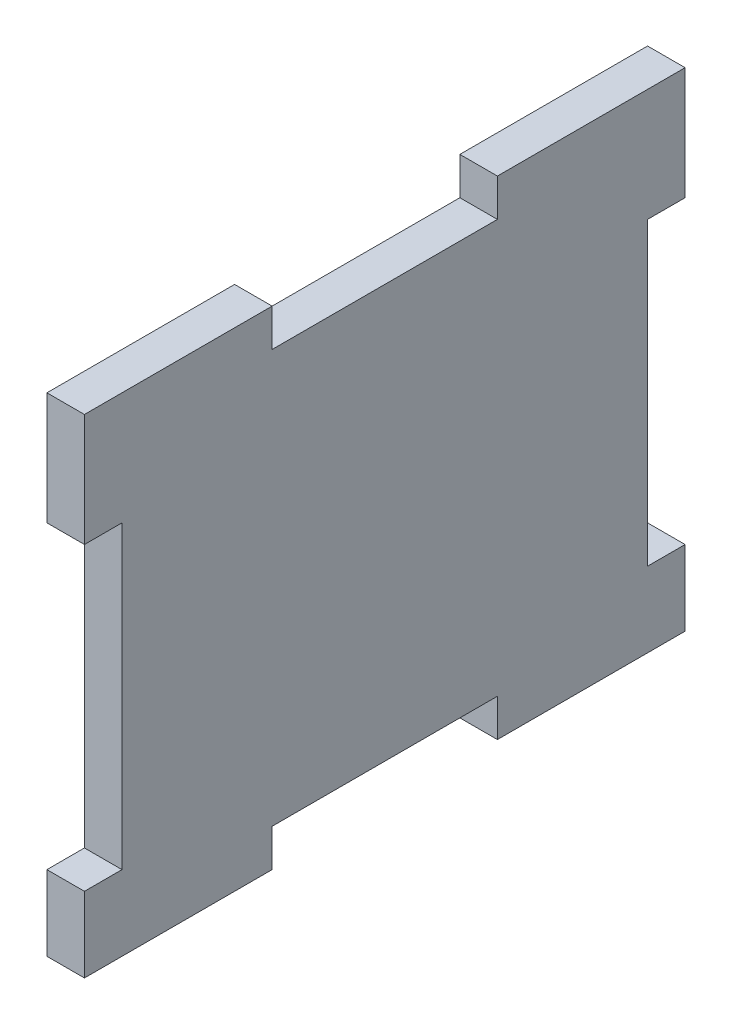
ISO-10303-21;
HEADER;
FILE_DESCRIPTION(('STEP AP214'),'2;1');
FILE_NAME('part.step','',(''),(''),'','','');
FILE_SCHEMA(('AUTOMOTIVE_DESIGN { 1 0 10303 214 1 1 1 1 }'));
ENDSEC;
DATA;
#1=APPLICATION_CONTEXT('core data for automotive mechanical design processes');
#2=APPLICATION_PROTOCOL_DEFINITION('international standard','automotive_design',2000,#1);
#3=PRODUCT_CONTEXT('',#1,'mechanical');
#4=PRODUCT('Part','Part','',(#3));
#5=PRODUCT_RELATED_PRODUCT_CATEGORY('part','',(#4));
#6=PRODUCT_DEFINITION_FORMATION('','',#4);
#7=PRODUCT_DEFINITION_CONTEXT('part definition',#1,'design');
#8=PRODUCT_DEFINITION('design','',#6,#7);
#9=PRODUCT_DEFINITION_SHAPE('','',#8);
#10=(LENGTH_UNIT() NAMED_UNIT(*) SI_UNIT(.MILLI.,.METRE.));
#11=(NAMED_UNIT(*) PLANE_ANGLE_UNIT() SI_UNIT($,.RADIAN.));
#12=(NAMED_UNIT(*) SI_UNIT($,.STERADIAN.) SOLID_ANGLE_UNIT());
#13=UNCERTAINTY_MEASURE_WITH_UNIT(LENGTH_MEASURE(1.E-05),#10,'distance_accuracy_value','');
#14=(GEOMETRIC_REPRESENTATION_CONTEXT(3) GLOBAL_UNCERTAINTY_ASSIGNED_CONTEXT((#13)) GLOBAL_UNIT_ASSIGNED_CONTEXT((#10,
#11,#12)) REPRESENTATION_CONTEXT('',''));
#15=CARTESIAN_POINT('',(0.,0.,0.));
#16=DIRECTION('',(0.,0.,1.));
#17=DIRECTION('',(1.,0.,0.));
#18=AXIS2_PLACEMENT_3D('',#15,#16,#17);
#19=CARTESIAN_POINT('',(6.35,41.275,0.));
#20=DIRECTION('',(0.,1.,0.));
#21=DIRECTION('',(0.,0.,1.));
#22=AXIS2_PLACEMENT_3D('',#19,#20,#21);
#23=PLANE('',#22);
#24=DIRECTION('',(0.,0.,-1.));
#25=VECTOR('',#24,1.);
#26=CARTESIAN_POINT('',(0.,41.275,0.));
#27=LINE('',#26,#25);
#28=CARTESIAN_POINT('',(0.,41.275,-19.05));
#29=VERTEX_POINT('',#28);
#30=CARTESIAN_POINT('',(0.,41.275,-50.8));
#31=VERTEX_POINT('',#30);
#32=EDGE_CURVE('E203',#29,#31,#27,.T.);
#33=ORIENTED_EDGE('',*,*,#32,.F.);
#34=DIRECTION('',(-1.,0.,0.));
#35=VECTOR('',#34,1.);
#36=CARTESIAN_POINT('',(6.35,41.275,-19.05));
#37=LINE('',#36,#35);
#38=CARTESIAN_POINT('',(6.35,41.275,-19.05));
#39=VERTEX_POINT('',#38);
#40=EDGE_CURVE('E11',#39,#29,#37,.T.);
#41=ORIENTED_EDGE('',*,*,#40,.F.);
#42=DIRECTION('',(0.,0.,-1.));
#43=VECTOR('',#42,1.);
#44=CARTESIAN_POINT('',(6.35,41.275,0.));
#45=LINE('',#44,#43);
#46=CARTESIAN_POINT('',(6.35,41.275,-50.8));
#47=VERTEX_POINT('',#46);
#48=EDGE_CURVE('E307',#39,#47,#45,.T.);
#49=ORIENTED_EDGE('',*,*,#48,.T.);
#50=DIRECTION('',(-1.,0.,0.));
#51=VECTOR('',#50,1.);
#52=CARTESIAN_POINT('',(6.35,41.275,-50.8));
#53=LINE('',#52,#51);
#54=EDGE_CURVE('E122',#47,#31,#53,.T.);
#55=ORIENTED_EDGE('',*,*,#54,.T.);
#56=EDGE_LOOP('',(#33,#41,#49,#55));
#57=FACE_BOUND('',#56,.T.);
#58=ADVANCED_FACE('F35',(#57),#23,.T.);
#59=CARTESIAN_POINT('',(6.35,0.,-19.05));
#60=DIRECTION('',(0.,0.,-1.));
#61=DIRECTION('',(-1.,0.,0.));
#62=AXIS2_PLACEMENT_3D('',#59,#60,#61);
#63=PLANE('',#62);
#64=DIRECTION('',(0.,-1.,0.));
#65=VECTOR('',#64,1.);
#66=CARTESIAN_POINT('',(0.,0.,-19.05));
#67=LINE('',#66,#65);
#68=CARTESIAN_POINT('',(0.,34.925,-19.05));
#69=VERTEX_POINT('',#68);
#70=EDGE_CURVE('E206',#29,#69,#67,.T.);
#71=ORIENTED_EDGE('',*,*,#70,.T.);
#72=DIRECTION('',(-1.,0.,0.));
#73=VECTOR('',#72,1.);
#74=CARTESIAN_POINT('',(6.35,34.925,-19.05));
#75=LINE('',#74,#73);
#76=CARTESIAN_POINT('',(6.35,34.925,-19.05));
#77=VERTEX_POINT('',#76);
#78=EDGE_CURVE('E44',#77,#69,#75,.T.);
#79=ORIENTED_EDGE('',*,*,#78,.F.);
#80=DIRECTION('',(0.,-1.,0.));
#81=VECTOR('',#80,1.);
#82=CARTESIAN_POINT('',(6.35,0.,-19.05));
#83=LINE('',#82,#81);
#84=EDGE_CURVE('E303',#39,#77,#83,.T.);
#85=ORIENTED_EDGE('',*,*,#84,.F.);
#86=ORIENTED_EDGE('',*,*,#40,.T.);
#87=EDGE_LOOP('',(#71,#79,#85,#86));
#88=FACE_BOUND('',#87,.T.);
#89=ADVANCED_FACE('F37',(#88),#63,.F.);
#90=CARTESIAN_POINT('',(6.35,34.925,0.));
#91=DIRECTION('',(0.,1.,0.));
#92=DIRECTION('',(0.,0.,1.));
#93=AXIS2_PLACEMENT_3D('',#90,#91,#92);
#94=PLANE('',#93);
#95=DIRECTION('',(0.,0.,-1.));
#96=VECTOR('',#95,1.);
#97=CARTESIAN_POINT('',(0.,34.925,0.));
#98=LINE('',#97,#96);
#99=CARTESIAN_POINT('',(0.,34.925,19.05));
#100=VERTEX_POINT('',#99);
#101=EDGE_CURVE('E210',#100,#69,#98,.T.);
#102=ORIENTED_EDGE('',*,*,#101,.F.);
#103=DIRECTION('',(-1.,0.,0.));
#104=VECTOR('',#103,1.);
#105=CARTESIAN_POINT('',(6.35,34.925,19.05));
#106=LINE('',#105,#104);
#107=CARTESIAN_POINT('',(6.35,34.925,19.05));
#108=VERTEX_POINT('',#107);
#109=EDGE_CURVE('E281',#108,#100,#106,.T.);
#110=ORIENTED_EDGE('',*,*,#109,.F.);
#111=DIRECTION('',(0.,0.,-1.));
#112=VECTOR('',#111,1.);
#113=CARTESIAN_POINT('',(6.35,34.925,0.));
#114=LINE('',#113,#112);
#115=EDGE_CURVE('E288',#108,#77,#114,.T.);
#116=ORIENTED_EDGE('',*,*,#115,.T.);
#117=ORIENTED_EDGE('',*,*,#78,.T.);
#118=EDGE_LOOP('',(#102,#110,#116,#117));
#119=FACE_BOUND('',#118,.T.);
#120=ADVANCED_FACE('F286',(#119),#94,.T.);
#121=CARTESIAN_POINT('',(6.35,0.,19.05));
#122=DIRECTION('',(0.,0.,-1.));
#123=DIRECTION('',(-1.,0.,0.));
#124=AXIS2_PLACEMENT_3D('',#121,#122,#123);
#125=PLANE('',#124);
#126=DIRECTION('',(0.,-1.,0.));
#127=VECTOR('',#126,1.);
#128=CARTESIAN_POINT('',(0.,0.,19.05));
#129=LINE('',#128,#127);
#130=CARTESIAN_POINT('',(0.,41.275,19.05));
#131=VERTEX_POINT('',#130);
#132=EDGE_CURVE('E213',#131,#100,#129,.T.);
#133=ORIENTED_EDGE('',*,*,#132,.F.);
#134=DIRECTION('',(-1.,0.,0.));
#135=VECTOR('',#134,1.);
#136=CARTESIAN_POINT('',(6.35,41.275,19.05));
#137=LINE('',#136,#135);
#138=CARTESIAN_POINT('',(6.35,41.275,19.05));
#139=VERTEX_POINT('',#138);
#140=EDGE_CURVE('E279',#139,#131,#137,.T.);
#141=ORIENTED_EDGE('',*,*,#140,.F.);
#142=DIRECTION('',(0.,-1.,0.));
#143=VECTOR('',#142,1.);
#144=CARTESIAN_POINT('',(6.35,0.,19.05));
#145=LINE('',#144,#143);
#146=EDGE_CURVE('E300',#139,#108,#145,.T.);
#147=ORIENTED_EDGE('',*,*,#146,.T.);
#148=ORIENTED_EDGE('',*,*,#109,.T.);
#149=EDGE_LOOP('',(#133,#141,#147,#148));
#150=FACE_BOUND('',#149,.T.);
#151=ADVANCED_FACE('F297',(#150),#125,.T.);
#152=CARTESIAN_POINT('',(0.,41.275,50.8));
#153=VERTEX_POINT('',#152);
#154=EDGE_CURVE('E207',#153,#131,#27,.T.);
#155=ORIENTED_EDGE('',*,*,#154,.F.);
#156=DIRECTION('',(-1.,0.,0.));
#157=VECTOR('',#156,1.);
#158=CARTESIAN_POINT('',(6.35,41.275,50.8));
#159=LINE('',#158,#157);
#160=CARTESIAN_POINT('',(6.35,41.275,50.8));
#161=VERTEX_POINT('',#160);
#162=EDGE_CURVE('E277',#161,#153,#159,.T.);
#163=ORIENTED_EDGE('',*,*,#162,.F.);
#164=EDGE_CURVE('E305',#161,#139,#45,.T.);
#165=ORIENTED_EDGE('',*,*,#164,.T.);
#166=ORIENTED_EDGE('',*,*,#140,.T.);
#167=EDGE_LOOP('',(#155,#163,#165,#166));
#168=FACE_BOUND('',#167,.T.);
#169=ADVANCED_FACE('F347',(#168),#23,.T.);
#170=CARTESIAN_POINT('',(6.35,0.,50.8));
#171=DIRECTION('',(0.,0.,1.));
#172=DIRECTION('',(1.,0.,0.));
#173=AXIS2_PLACEMENT_3D('',#170,#171,#172);
#174=PLANE('',#173);
#175=DIRECTION('',(0.,1.,0.));
#176=VECTOR('',#175,1.);
#177=CARTESIAN_POINT('',(0.,0.,50.8));
#178=LINE('',#177,#176);
#179=CARTESIAN_POINT('',(0.,22.225,50.8));
#180=VERTEX_POINT('',#179);
#181=EDGE_CURVE('E216',#180,#153,#178,.T.);
#182=ORIENTED_EDGE('',*,*,#181,.F.);
#183=DIRECTION('',(-1.,0.,0.));
#184=VECTOR('',#183,1.);
#185=CARTESIAN_POINT('',(6.35,22.225,50.8));
#186=LINE('',#185,#184);
#187=CARTESIAN_POINT('',(6.35,22.225,50.8));
#188=VERTEX_POINT('',#187);
#189=EDGE_CURVE('E275',#188,#180,#186,.T.);
#190=ORIENTED_EDGE('',*,*,#189,.F.);
#191=DIRECTION('',(0.,1.,0.));
#192=VECTOR('',#191,1.);
#193=CARTESIAN_POINT('',(6.35,0.,50.8));
#194=LINE('',#193,#192);
#195=EDGE_CURVE('E311',#188,#161,#194,.T.);
#196=ORIENTED_EDGE('',*,*,#195,.T.);
#197=ORIENTED_EDGE('',*,*,#162,.T.);
#198=EDGE_LOOP('',(#182,#190,#196,#197));
#199=FACE_BOUND('',#198,.T.);
#200=ADVANCED_FACE('F351',(#199),#174,.T.);
#201=CARTESIAN_POINT('',(6.35,22.225,0.));
#202=DIRECTION('',(0.,1.,0.));
#203=DIRECTION('',(0.,0.,1.));
#204=AXIS2_PLACEMENT_3D('',#201,#202,#203);
#205=PLANE('',#204);
#206=DIRECTION('',(0.,0.,-1.));
#207=VECTOR('',#206,1.);
#208=CARTESIAN_POINT('',(0.,22.225,0.));
#209=LINE('',#208,#207);
#210=CARTESIAN_POINT('',(0.,22.225,44.45));
#211=VERTEX_POINT('',#210);
#212=EDGE_CURVE('E219',#180,#211,#209,.T.);
#213=ORIENTED_EDGE('',*,*,#212,.T.);
#214=DIRECTION('',(-1.,0.,0.));
#215=VECTOR('',#214,1.);
#216=CARTESIAN_POINT('',(6.35,22.225,44.45));
#217=LINE('',#216,#215);
#218=CARTESIAN_POINT('',(6.35,22.225,44.45));
#219=VERTEX_POINT('',#218);
#220=EDGE_CURVE('E273',#219,#211,#217,.T.);
#221=ORIENTED_EDGE('',*,*,#220,.F.);
#222=DIRECTION('',(0.,0.,-1.));
#223=VECTOR('',#222,1.);
#224=CARTESIAN_POINT('',(6.35,22.225,0.));
#225=LINE('',#224,#223);
#226=EDGE_CURVE('E314',#188,#219,#225,.T.);
#227=ORIENTED_EDGE('',*,*,#226,.F.);
#228=ORIENTED_EDGE('',*,*,#189,.T.);
#229=EDGE_LOOP('',(#213,#221,#227,#228));
#230=FACE_BOUND('',#229,.T.);
#231=ADVANCED_FACE('F356',(#230),#205,.F.);
#232=CARTESIAN_POINT('',(6.35,0.,44.45));
#233=DIRECTION('',(0.,0.,1.));
#234=DIRECTION('',(1.,0.,0.));
#235=AXIS2_PLACEMENT_3D('',#232,#233,#234);
#236=PLANE('',#235);
#237=DIRECTION('',(0.,1.,0.));
#238=VECTOR('',#237,1.);
#239=CARTESIAN_POINT('',(0.,0.,44.45));
#240=LINE('',#239,#238);
#241=CARTESIAN_POINT('',(0.,-28.575,44.45));
#242=VERTEX_POINT('',#241);
#243=EDGE_CURVE('E223',#242,#211,#240,.T.);
#244=ORIENTED_EDGE('',*,*,#243,.F.);
#245=DIRECTION('',(-1.,0.,0.));
#246=VECTOR('',#245,1.);
#247=CARTESIAN_POINT('',(6.35,-28.575,44.45));
#248=LINE('',#247,#246);
#249=CARTESIAN_POINT('',(6.35,-28.575,44.45));
#250=VERTEX_POINT('',#249);
#251=EDGE_CURVE('E271',#250,#242,#248,.T.);
#252=ORIENTED_EDGE('',*,*,#251,.F.);
#253=DIRECTION('',(0.,1.,0.));
#254=VECTOR('',#253,1.);
#255=CARTESIAN_POINT('',(6.35,0.,44.45));
#256=LINE('',#255,#254);
#257=EDGE_CURVE('E317',#250,#219,#256,.T.);
#258=ORIENTED_EDGE('',*,*,#257,.T.);
#259=ORIENTED_EDGE('',*,*,#220,.T.);
#260=EDGE_LOOP('',(#244,#252,#258,#259));
#261=FACE_BOUND('',#260,.T.);
#262=ADVANCED_FACE('F388',(#261),#236,.T.);
#263=CARTESIAN_POINT('',(6.35,-28.575,0.));
#264=DIRECTION('',(0.,1.,0.));
#265=DIRECTION('',(0.,0.,1.));
#266=AXIS2_PLACEMENT_3D('',#263,#264,#265);
#267=PLANE('',#266);
#268=DIRECTION('',(0.,0.,-1.));
#269=VECTOR('',#268,1.);
#270=CARTESIAN_POINT('',(0.,-28.575,0.));
#271=LINE('',#270,#269);
#272=CARTESIAN_POINT('',(0.,-28.575,50.8));
#273=VERTEX_POINT('',#272);
#274=EDGE_CURVE('E226',#273,#242,#271,.T.);
#275=ORIENTED_EDGE('',*,*,#274,.F.);
#276=DIRECTION('',(-1.,0.,0.));
#277=VECTOR('',#276,1.);
#278=CARTESIAN_POINT('',(6.35,-28.575,50.8));
#279=LINE('',#278,#277);
#280=CARTESIAN_POINT('',(6.35,-28.575,50.8));
#281=VERTEX_POINT('',#280);
#282=EDGE_CURVE('E269',#281,#273,#279,.T.);
#283=ORIENTED_EDGE('',*,*,#282,.F.);
#284=DIRECTION('',(0.,0.,-1.));
#285=VECTOR('',#284,1.);
#286=CARTESIAN_POINT('',(6.35,-28.575,0.));
#287=LINE('',#286,#285);
#288=EDGE_CURVE('E320',#281,#250,#287,.T.);
#289=ORIENTED_EDGE('',*,*,#288,.T.);
#290=ORIENTED_EDGE('',*,*,#251,.T.);
#291=EDGE_LOOP('',(#275,#283,#289,#290));
#292=FACE_BOUND('',#291,.T.);
#293=ADVANCED_FACE('F364',(#292),#267,.T.);
#294=CARTESIAN_POINT('',(0.,-41.275,50.8));
#295=VERTEX_POINT('',#294);
#296=EDGE_CURVE('E220',#295,#273,#178,.T.);
#297=ORIENTED_EDGE('',*,*,#296,.F.);
#298=DIRECTION('',(-1.,0.,0.));
#299=VECTOR('',#298,1.);
#300=CARTESIAN_POINT('',(6.35,-41.275,50.8));
#301=LINE('',#300,#299);
#302=CARTESIAN_POINT('',(6.35,-41.275,50.8));
#303=VERTEX_POINT('',#302);
#304=EDGE_CURVE('E267',#303,#295,#301,.T.);
#305=ORIENTED_EDGE('',*,*,#304,.F.);
#306=EDGE_CURVE('E315',#303,#281,#194,.T.);
#307=ORIENTED_EDGE('',*,*,#306,.T.);
#308=ORIENTED_EDGE('',*,*,#282,.T.);
#309=EDGE_LOOP('',(#297,#305,#307,#308));
#310=FACE_BOUND('',#309,.T.);
#311=ADVANCED_FACE('F369',(#310),#174,.T.);
#312=CARTESIAN_POINT('',(6.35,-41.275,0.));
#313=DIRECTION('',(0.,1.,0.));
#314=DIRECTION('',(0.,0.,1.));
#315=AXIS2_PLACEMENT_3D('',#312,#313,#314);
#316=PLANE('',#315);
#317=DIRECTION('',(0.,0.,-1.));
#318=VECTOR('',#317,1.);
#319=CARTESIAN_POINT('',(0.,-41.275,0.));
#320=LINE('',#319,#318);
#321=CARTESIAN_POINT('',(0.,-41.275,19.05));
#322=VERTEX_POINT('',#321);
#323=EDGE_CURVE('E229',#295,#322,#320,.T.);
#324=ORIENTED_EDGE('',*,*,#323,.T.);
#325=DIRECTION('',(-1.,0.,0.));
#326=VECTOR('',#325,1.);
#327=CARTESIAN_POINT('',(6.35,-41.275,19.05));
#328=LINE('',#327,#326);
#329=CARTESIAN_POINT('',(6.35,-41.275,19.05));
#330=VERTEX_POINT('',#329);
#331=EDGE_CURVE('E264',#330,#322,#328,.T.);
#332=ORIENTED_EDGE('',*,*,#331,.F.);
#333=DIRECTION('',(0.,0.,-1.));
#334=VECTOR('',#333,1.);
#335=CARTESIAN_POINT('',(6.35,-41.275,0.));
#336=LINE('',#335,#334);
#337=EDGE_CURVE('E323',#303,#330,#336,.T.);
#338=ORIENTED_EDGE('',*,*,#337,.F.);
#339=ORIENTED_EDGE('',*,*,#304,.T.);
#340=EDGE_LOOP('',(#324,#332,#338,#339));
#341=FACE_BOUND('',#340,.T.);
#342=ADVANCED_FACE('F375',(#341),#316,.F.);
#343=CARTESIAN_POINT('',(6.35,0.,19.05));
#344=DIRECTION('',(0.,0.,1.));
#345=DIRECTION('',(1.,0.,0.));
#346=AXIS2_PLACEMENT_3D('',#343,#344,#345);
#347=PLANE('',#346);
#348=DIRECTION('',(0.,1.,0.));
#349=VECTOR('',#348,1.);
#350=CARTESIAN_POINT('',(0.,0.,19.05));
#351=LINE('',#350,#349);
#352=CARTESIAN_POINT('',(0.,-34.925,19.05));
#353=VERTEX_POINT('',#352);
#354=EDGE_CURVE('E231',#322,#353,#351,.T.);
#355=ORIENTED_EDGE('',*,*,#354,.T.);
#356=DIRECTION('',(-1.,0.,0.));
#357=VECTOR('',#356,1.);
#358=CARTESIAN_POINT('',(6.35,-34.925,19.05));
#359=LINE('',#358,#357);
#360=CARTESIAN_POINT('',(6.35,-34.925,19.05));
#361=VERTEX_POINT('',#360);
#362=EDGE_CURVE('E261',#361,#353,#359,.T.);
#363=ORIENTED_EDGE('',*,*,#362,.F.);
#364=DIRECTION('',(0.,1.,0.));
#365=VECTOR('',#364,1.);
#366=CARTESIAN_POINT('',(6.35,0.,19.05));
#367=LINE('',#366,#365);
#368=EDGE_CURVE('E325',#330,#361,#367,.T.);
#369=ORIENTED_EDGE('',*,*,#368,.F.);
#370=ORIENTED_EDGE('',*,*,#331,.T.);
#371=EDGE_LOOP('',(#355,#363,#369,#370));
#372=FACE_BOUND('',#371,.T.);
#373=ADVANCED_FACE('F379',(#372),#347,.F.);
#374=CARTESIAN_POINT('',(6.35,-34.925,0.));
#375=DIRECTION('',(0.,1.,0.));
#376=DIRECTION('',(0.,0.,1.));
#377=AXIS2_PLACEMENT_3D('',#374,#375,#376);
#378=PLANE('',#377);
#379=DIRECTION('',(0.,0.,-1.));
#380=VECTOR('',#379,1.);
#381=CARTESIAN_POINT('',(0.,-34.925,0.));
#382=LINE('',#381,#380);
#383=CARTESIAN_POINT('',(0.,-34.925,-19.05));
#384=VERTEX_POINT('',#383);
#385=EDGE_CURVE('E234',#353,#384,#382,.T.);
#386=ORIENTED_EDGE('',*,*,#385,.T.);
#387=DIRECTION('',(-1.,0.,0.));
#388=VECTOR('',#387,1.);
#389=CARTESIAN_POINT('',(6.35,-34.925,-19.05));
#390=LINE('',#389,#388);
#391=CARTESIAN_POINT('',(6.35,-34.925,-19.05));
#392=VERTEX_POINT('',#391);
#393=EDGE_CURVE('E259',#392,#384,#390,.T.);
#394=ORIENTED_EDGE('',*,*,#393,.F.);
#395=DIRECTION('',(0.,0.,-1.));
#396=VECTOR('',#395,1.);
#397=CARTESIAN_POINT('',(6.35,-34.925,0.));
#398=LINE('',#397,#396);
#399=EDGE_CURVE('E328',#361,#392,#398,.T.);
#400=ORIENTED_EDGE('',*,*,#399,.F.);
#401=ORIENTED_EDGE('',*,*,#362,.T.);
#402=EDGE_LOOP('',(#386,#394,#400,#401));
#403=FACE_BOUND('',#402,.T.);
#404=ADVANCED_FACE('F384',(#403),#378,.F.);
#405=CARTESIAN_POINT('',(6.35,0.,-19.05));
#406=DIRECTION('',(0.,0.,1.));
#407=DIRECTION('',(1.,0.,0.));
#408=AXIS2_PLACEMENT_3D('',#405,#406,#407);
#409=PLANE('',#408);
#410=DIRECTION('',(0.,1.,0.));
#411=VECTOR('',#410,1.);
#412=CARTESIAN_POINT('',(0.,0.,-19.05));
#413=LINE('',#412,#411);
#414=CARTESIAN_POINT('',(0.,-41.275,-19.05));
#415=VERTEX_POINT('',#414);
#416=EDGE_CURVE('E237',#415,#384,#413,.T.);
#417=ORIENTED_EDGE('',*,*,#416,.F.);
#418=DIRECTION('',(-1.,0.,0.));
#419=VECTOR('',#418,1.);
#420=CARTESIAN_POINT('',(6.35,-41.275,-19.05));
#421=LINE('',#420,#419);
#422=CARTESIAN_POINT('',(6.35,-41.275,-19.05));
#423=VERTEX_POINT('',#422);
#424=EDGE_CURVE('E257',#423,#415,#421,.T.);
#425=ORIENTED_EDGE('',*,*,#424,.F.);
#426=DIRECTION('',(0.,1.,0.));
#427=VECTOR('',#426,1.);
#428=CARTESIAN_POINT('',(6.35,0.,-19.05));
#429=LINE('',#428,#427);
#430=EDGE_CURVE('E330',#423,#392,#429,.T.);
#431=ORIENTED_EDGE('',*,*,#430,.T.);
#432=ORIENTED_EDGE('',*,*,#393,.T.);
#433=EDGE_LOOP('',(#417,#425,#431,#432));
#434=FACE_BOUND('',#433,.T.);
#435=ADVANCED_FACE('F387',(#434),#409,.T.);
#436=CARTESIAN_POINT('',(0.,-41.275,-50.8));
#437=VERTEX_POINT('',#436);
#438=EDGE_CURVE('E232',#415,#437,#320,.T.);
#439=ORIENTED_EDGE('',*,*,#438,.T.);
#440=DIRECTION('',(-1.,0.,0.));
#441=VECTOR('',#440,1.);
#442=CARTESIAN_POINT('',(6.35,-41.275,-50.8));
#443=LINE('',#442,#441);
#444=CARTESIAN_POINT('',(6.35,-41.275,-50.8));
#445=VERTEX_POINT('',#444);
#446=EDGE_CURVE('E254',#445,#437,#443,.T.);
#447=ORIENTED_EDGE('',*,*,#446,.F.);
#448=EDGE_CURVE('E326',#423,#445,#336,.T.);
#449=ORIENTED_EDGE('',*,*,#448,.F.);
#450=ORIENTED_EDGE('',*,*,#424,.T.);
#451=EDGE_LOOP('',(#439,#447,#449,#450));
#452=FACE_BOUND('',#451,.T.);
#453=ADVANCED_FACE('F338',(#452),#316,.F.);
#454=CARTESIAN_POINT('',(6.35,0.,-50.8));
#455=DIRECTION('',(0.,0.,1.));
#456=DIRECTION('',(1.,0.,0.));
#457=AXIS2_PLACEMENT_3D('',#454,#455,#456);
#458=PLANE('',#457);
#459=DIRECTION('',(0.,1.,0.));
#460=VECTOR('',#459,1.);
#461=CARTESIAN_POINT('',(0.,0.,-50.8));
#462=LINE('',#461,#460);
#463=CARTESIAN_POINT('',(0.,-28.575,-50.8));
#464=VERTEX_POINT('',#463);
#465=EDGE_CURVE('E240',#437,#464,#462,.T.);
#466=ORIENTED_EDGE('',*,*,#465,.T.);
#467=DIRECTION('',(-1.,0.,0.));
#468=VECTOR('',#467,1.);
#469=CARTESIAN_POINT('',(6.35,-28.575,-50.8));
#470=LINE('',#469,#468);
#471=CARTESIAN_POINT('',(6.35,-28.575,-50.8));
#472=VERTEX_POINT('',#471);
#473=EDGE_CURVE('E251',#472,#464,#470,.T.);
#474=ORIENTED_EDGE('',*,*,#473,.F.);
#475=DIRECTION('',(0.,1.,0.));
#476=VECTOR('',#475,1.);
#477=CARTESIAN_POINT('',(6.35,0.,-50.8));
#478=LINE('',#477,#476);
#479=EDGE_CURVE('E200',#445,#472,#478,.T.);
#480=ORIENTED_EDGE('',*,*,#479,.F.);
#481=ORIENTED_EDGE('',*,*,#446,.T.);
#482=EDGE_LOOP('',(#466,#474,#480,#481));
#483=FACE_BOUND('',#482,.T.);
#484=ADVANCED_FACE('F342',(#483),#458,.F.);
#485=CARTESIAN_POINT('',(6.35,-28.575,0.));
#486=DIRECTION('',(0.,-1.,0.));
#487=DIRECTION('',(0.,0.,-1.));
#488=AXIS2_PLACEMENT_3D('',#485,#486,#487);
#489=PLANE('',#488);
#490=DIRECTION('',(0.,0.,1.));
#491=VECTOR('',#490,1.);
#492=CARTESIAN_POINT('',(0.,-28.575,0.));
#493=LINE('',#492,#491);
#494=CARTESIAN_POINT('',(0.,-28.575,-44.45));
#495=VERTEX_POINT('',#494);
#496=EDGE_CURVE('E242',#464,#495,#493,.T.);
#497=ORIENTED_EDGE('',*,*,#496,.T.);
#498=DIRECTION('',(-1.,0.,0.));
#499=VECTOR('',#498,1.);
#500=CARTESIAN_POINT('',(6.35,-28.575,-44.45));
#501=LINE('',#500,#499);
#502=CARTESIAN_POINT('',(6.35,-28.575,-44.45));
#503=VERTEX_POINT('',#502);
#504=EDGE_CURVE('E195',#503,#495,#501,.T.);
#505=ORIENTED_EDGE('',*,*,#504,.F.);
#506=DIRECTION('',(0.,0.,1.));
#507=VECTOR('',#506,1.);
#508=CARTESIAN_POINT('',(6.35,-28.575,0.));
#509=LINE('',#508,#507);
#510=EDGE_CURVE('E182',#472,#503,#509,.T.);
#511=ORIENTED_EDGE('',*,*,#510,.F.);
#512=ORIENTED_EDGE('',*,*,#473,.T.);
#513=EDGE_LOOP('',(#497,#505,#511,#512));
#514=FACE_BOUND('',#513,.T.);
#515=ADVANCED_FACE('F345',(#514),#489,.F.);
#516=CARTESIAN_POINT('',(6.35,0.,-44.45));
#517=DIRECTION('',(0.,0.,1.));
#518=DIRECTION('',(1.,0.,0.));
#519=AXIS2_PLACEMENT_3D('',#516,#517,#518);
#520=PLANE('',#519);
#521=DIRECTION('',(0.,1.,0.));
#522=VECTOR('',#521,1.);
#523=CARTESIAN_POINT('',(0.,0.,-44.45));
#524=LINE('',#523,#522);
#525=CARTESIAN_POINT('',(0.,22.225,-44.45));
#526=VERTEX_POINT('',#525);
#527=EDGE_CURVE('E191',#495,#526,#524,.T.);
#528=ORIENTED_EDGE('',*,*,#527,.T.);
#529=DIRECTION('',(-1.,0.,0.));
#530=VECTOR('',#529,1.);
#531=CARTESIAN_POINT('',(6.35,22.225,-44.45));
#532=LINE('',#531,#530);
#533=CARTESIAN_POINT('',(6.35,22.225,-44.45));
#534=VERTEX_POINT('',#533);
#535=EDGE_CURVE('E188',#534,#526,#532,.T.);
#536=ORIENTED_EDGE('',*,*,#535,.F.);
#537=DIRECTION('',(0.,1.,0.));
#538=VECTOR('',#537,1.);
#539=CARTESIAN_POINT('',(6.35,0.,-44.45));
#540=LINE('',#539,#538);
#541=EDGE_CURVE('E176',#503,#534,#540,.T.);
#542=ORIENTED_EDGE('',*,*,#541,.F.);
#543=ORIENTED_EDGE('',*,*,#504,.T.);
#544=EDGE_LOOP('',(#528,#536,#542,#543));
#545=FACE_BOUND('',#544,.T.);
#546=ADVANCED_FACE('F189',(#545),#520,.F.);
#547=CARTESIAN_POINT('',(6.35,22.225,0.));
#548=DIRECTION('',(0.,-1.,0.));
#549=DIRECTION('',(0.,0.,-1.));
#550=AXIS2_PLACEMENT_3D('',#547,#548,#549);
#551=PLANE('',#550);
#552=DIRECTION('',(0.,0.,1.));
#553=VECTOR('',#552,1.);
#554=CARTESIAN_POINT('',(0.,22.225,0.));
#555=LINE('',#554,#553);
#556=CARTESIAN_POINT('',(0.,22.225,-50.8));
#557=VERTEX_POINT('',#556);
#558=EDGE_CURVE('E246',#557,#526,#555,.T.);
#559=ORIENTED_EDGE('',*,*,#558,.F.);
#560=DIRECTION('',(-1.,0.,0.));
#561=VECTOR('',#560,1.);
#562=CARTESIAN_POINT('',(6.35,22.225,-50.8));
#563=LINE('',#562,#561);
#564=CARTESIAN_POINT('',(6.35,22.225,-50.8));
#565=VERTEX_POINT('',#564);
#566=EDGE_CURVE('E115',#565,#557,#563,.T.);
#567=ORIENTED_EDGE('',*,*,#566,.F.);
#568=DIRECTION('',(0.,0.,1.));
#569=VECTOR('',#568,1.);
#570=CARTESIAN_POINT('',(6.35,22.225,0.));
#571=LINE('',#570,#569);
#572=EDGE_CURVE('E180',#565,#534,#571,.T.);
#573=ORIENTED_EDGE('',*,*,#572,.T.);
#574=ORIENTED_EDGE('',*,*,#535,.T.);
#575=EDGE_LOOP('',(#559,#567,#573,#574));
#576=FACE_BOUND('',#575,.T.);
#577=ADVANCED_FACE('F197',(#576),#551,.T.);
#578=EDGE_CURVE('E243',#557,#31,#462,.T.);
#579=ORIENTED_EDGE('',*,*,#578,.T.);
#580=ORIENTED_EDGE('',*,*,#54,.F.);
#581=EDGE_CURVE('E52',#565,#47,#478,.T.);
#582=ORIENTED_EDGE('',*,*,#581,.F.);
#583=ORIENTED_EDGE('',*,*,#566,.T.);
#584=EDGE_LOOP('',(#579,#580,#582,#583));
#585=FACE_BOUND('',#584,.T.);
#586=ADVANCED_FACE('F502',(#585),#458,.F.);
#587=CARTESIAN_POINT('',(6.35,0.,0.));
#588=DIRECTION('',(1.,0.,0.));
#589=DIRECTION('',(0.,0.,-1.));
#590=AXIS2_PLACEMENT_3D('',#587,#588,#589);
#591=PLANE('',#590);
#592=ORIENTED_EDGE('',*,*,#48,.F.);
#593=ORIENTED_EDGE('',*,*,#84,.T.);
#594=ORIENTED_EDGE('',*,*,#115,.F.);
#595=ORIENTED_EDGE('',*,*,#146,.F.);
#596=ORIENTED_EDGE('',*,*,#164,.F.);
#597=ORIENTED_EDGE('',*,*,#195,.F.);
#598=ORIENTED_EDGE('',*,*,#226,.T.);
#599=ORIENTED_EDGE('',*,*,#257,.F.);
#600=ORIENTED_EDGE('',*,*,#288,.F.);
#601=ORIENTED_EDGE('',*,*,#306,.F.);
#602=ORIENTED_EDGE('',*,*,#337,.T.);
#603=ORIENTED_EDGE('',*,*,#368,.T.);
#604=ORIENTED_EDGE('',*,*,#399,.T.);
#605=ORIENTED_EDGE('',*,*,#430,.F.);
#606=ORIENTED_EDGE('',*,*,#448,.T.);
#607=ORIENTED_EDGE('',*,*,#479,.T.);
#608=ORIENTED_EDGE('',*,*,#510,.T.);
#609=ORIENTED_EDGE('',*,*,#541,.T.);
#610=ORIENTED_EDGE('',*,*,#572,.F.);
#611=ORIENTED_EDGE('',*,*,#581,.T.);
#612=EDGE_LOOP('',(#592,#593,#594,#595,#596,#597,#598,#599,#600,#601,#602,#603,#604,#605,#606,
#607,#608,#609,#610,#611));
#613=FACE_BOUND('',#612,.T.);
#614=ADVANCED_FACE('F178',(#613),#591,.T.);
#615=CARTESIAN_POINT('',(0.,0.,0.));
#616=DIRECTION('',(1.,0.,0.));
#617=DIRECTION('',(0.,0.,-1.));
#618=AXIS2_PLACEMENT_3D('',#615,#616,#617);
#619=PLANE('',#618);
#620=ORIENTED_EDGE('',*,*,#32,.T.);
#621=ORIENTED_EDGE('',*,*,#578,.F.);
#622=ORIENTED_EDGE('',*,*,#558,.T.);
#623=ORIENTED_EDGE('',*,*,#527,.F.);
#624=ORIENTED_EDGE('',*,*,#496,.F.);
#625=ORIENTED_EDGE('',*,*,#465,.F.);
#626=ORIENTED_EDGE('',*,*,#438,.F.);
#627=ORIENTED_EDGE('',*,*,#416,.T.);
#628=ORIENTED_EDGE('',*,*,#385,.F.);
#629=ORIENTED_EDGE('',*,*,#354,.F.);
#630=ORIENTED_EDGE('',*,*,#323,.F.);
#631=ORIENTED_EDGE('',*,*,#296,.T.);
#632=ORIENTED_EDGE('',*,*,#274,.T.);
#633=ORIENTED_EDGE('',*,*,#243,.T.);
#634=ORIENTED_EDGE('',*,*,#212,.F.);
#635=ORIENTED_EDGE('',*,*,#181,.T.);
#636=ORIENTED_EDGE('',*,*,#154,.T.);
#637=ORIENTED_EDGE('',*,*,#132,.T.);
#638=ORIENTED_EDGE('',*,*,#101,.T.);
#639=ORIENTED_EDGE('',*,*,#70,.F.);
#640=EDGE_LOOP('',(#620,#621,#622,#623,#624,#625,#626,#627,#628,#629,#630,#631,#632,#633,#634,
#635,#636,#637,#638,#639));
#641=FACE_BOUND('',#640,.T.);
#642=ADVANCED_FACE('F292',(#641),#619,.F.);
#643=CLOSED_SHELL('',(#58,#89,#120,#151,#169,#200,#231,#262,#293,#311,#342,#373,#404,#435,#453,
#484,#515,#546,#577,#586,#614,#642));
#644=MANIFOLD_SOLID_BREP('B2',#643);
#645=ADVANCED_BREP_SHAPE_REPRESENTATION('',(#18,#644),#14);
#646=SHAPE_DEFINITION_REPRESENTATION(#9,#645);
ENDSEC;
END-ISO-10303-21;
